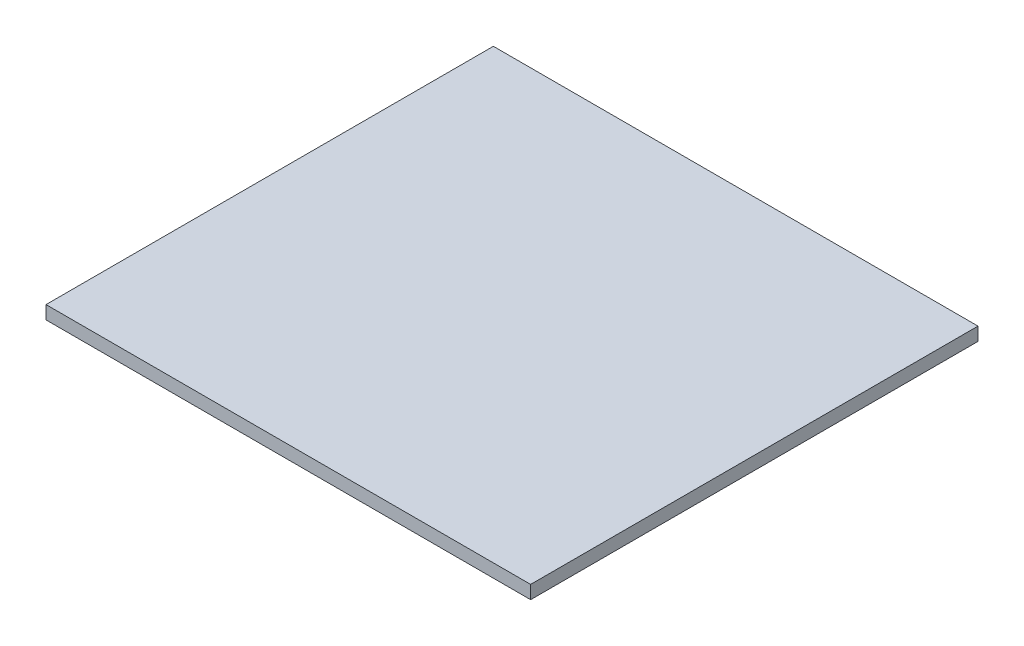
ISO-10303-21;
HEADER;
FILE_DESCRIPTION(('STEP AP214'),'2;1');
FILE_NAME('part.step','',(''),(''),'','','');
FILE_SCHEMA(('AUTOMOTIVE_DESIGN { 1 0 10303 214 1 1 1 1 }'));
ENDSEC;
DATA;
#1=APPLICATION_CONTEXT('core data for automotive mechanical design processes');
#2=APPLICATION_PROTOCOL_DEFINITION('international standard','automotive_design',2000,#1);
#3=PRODUCT_CONTEXT('',#1,'mechanical');
#4=PRODUCT('Part','Part','',(#3));
#5=PRODUCT_RELATED_PRODUCT_CATEGORY('part','',(#4));
#6=PRODUCT_DEFINITION_FORMATION('','',#4);
#7=PRODUCT_DEFINITION_CONTEXT('part definition',#1,'design');
#8=PRODUCT_DEFINITION('design','',#6,#7);
#9=PRODUCT_DEFINITION_SHAPE('','',#8);
#10=(LENGTH_UNIT() NAMED_UNIT(*) SI_UNIT(.MILLI.,.METRE.));
#11=(NAMED_UNIT(*) PLANE_ANGLE_UNIT() SI_UNIT($,.RADIAN.));
#12=(NAMED_UNIT(*) SI_UNIT($,.STERADIAN.) SOLID_ANGLE_UNIT());
#13=UNCERTAINTY_MEASURE_WITH_UNIT(LENGTH_MEASURE(1.E-05),#10,'distance_accuracy_value','');
#14=(GEOMETRIC_REPRESENTATION_CONTEXT(3) GLOBAL_UNCERTAINTY_ASSIGNED_CONTEXT((#13)) GLOBAL_UNIT_ASSIGNED_CONTEXT((#10,
#11,#12)) REPRESENTATION_CONTEXT('',''));
#15=CARTESIAN_POINT('',(0.,0.,0.));
#16=DIRECTION('',(0.,0.,1.));
#17=DIRECTION('',(1.,0.,0.));
#18=AXIS2_PLACEMENT_3D('',#15,#16,#17);
#19=CARTESIAN_POINT('',(-118.587048432742,2.2606,-65.1334894155714));
#20=DIRECTION('',(1.,0.,0.));
#21=DIRECTION('',(0.,0.,-1.));
#22=AXIS2_PLACEMENT_3D('',#19,#20,#21);
#23=PLANE('',#22);
#24=DIRECTION('',(0.,0.,1.));
#25=VECTOR('',#24,1.);
#26=CARTESIAN_POINT('',(-118.587048432742,0.,-65.1334894155714));
#27=LINE('',#26,#25);
#28=CARTESIAN_POINT('',(-118.587048432742,0.,-65.1334894155714));
#29=VERTEX_POINT('',#28);
#30=CARTESIAN_POINT('',(-118.587048432742,0.,11.0665105844286));
#31=VERTEX_POINT('',#30);
#32=EDGE_CURVE('E100',#29,#31,#27,.T.);
#33=ORIENTED_EDGE('',*,*,#32,.T.);
#34=DIRECTION('',(0.,-1.,0.));
#35=VECTOR('',#34,1.);
#36=CARTESIAN_POINT('',(-118.587048432742,2.2606,11.0665105844286));
#37=LINE('',#36,#35);
#38=CARTESIAN_POINT('',(-118.587048432742,2.2606,11.0665105844286));
#39=VERTEX_POINT('',#38);
#40=EDGE_CURVE('E11',#39,#31,#37,.T.);
#41=ORIENTED_EDGE('',*,*,#40,.F.);
#42=DIRECTION('',(0.,0.,1.));
#43=VECTOR('',#42,1.);
#44=CARTESIAN_POINT('',(-118.587048432742,2.2606,-65.1334894155714));
#45=LINE('',#44,#43);
#46=CARTESIAN_POINT('',(-118.587048432742,2.2606,-65.1334894155714));
#47=VERTEX_POINT('',#46);
#48=EDGE_CURVE('E88',#47,#39,#45,.T.);
#49=ORIENTED_EDGE('',*,*,#48,.F.);
#50=DIRECTION('',(0.,-1.,0.));
#51=VECTOR('',#50,1.);
#52=CARTESIAN_POINT('',(-118.587048432742,2.2606,-65.1334894155714));
#53=LINE('',#52,#51);
#54=EDGE_CURVE('E96',#47,#29,#53,.T.);
#55=ORIENTED_EDGE('',*,*,#54,.T.);
#56=EDGE_LOOP('',(#33,#41,#49,#55));
#57=FACE_BOUND('',#56,.T.);
#58=ADVANCED_FACE('F37',(#57),#23,.F.);
#59=CARTESIAN_POINT('',(-118.587048432742,2.2606,11.0665105844286));
#60=DIRECTION('',(0.,0.,-1.));
#61=DIRECTION('',(-1.,0.,0.));
#62=AXIS2_PLACEMENT_3D('',#59,#60,#61);
#63=PLANE('',#62);
#64=DIRECTION('',(1.,0.,0.));
#65=VECTOR('',#64,1.);
#66=CARTESIAN_POINT('',(-118.587048432742,0.,11.0665105844286));
#67=LINE('',#66,#65);
#68=CARTESIAN_POINT('',(-36.0370484327421,0.,11.0665105844286));
#69=VERTEX_POINT('',#68);
#70=EDGE_CURVE('E92',#31,#69,#67,.T.);
#71=ORIENTED_EDGE('',*,*,#70,.T.);
#72=DIRECTION('',(0.,-1.,0.));
#73=VECTOR('',#72,1.);
#74=CARTESIAN_POINT('',(-36.0370484327421,2.2606,11.0665105844286));
#75=LINE('',#74,#73);
#76=CARTESIAN_POINT('',(-36.0370484327421,2.2606,11.0665105844286));
#77=VERTEX_POINT('',#76);
#78=EDGE_CURVE('E45',#77,#69,#75,.T.);
#79=ORIENTED_EDGE('',*,*,#78,.F.);
#80=DIRECTION('',(1.,0.,0.));
#81=VECTOR('',#80,1.);
#82=CARTESIAN_POINT('',(-118.587048432742,2.2606,11.0665105844286));
#83=LINE('',#82,#81);
#84=EDGE_CURVE('E83',#39,#77,#83,.T.);
#85=ORIENTED_EDGE('',*,*,#84,.F.);
#86=ORIENTED_EDGE('',*,*,#40,.T.);
#87=EDGE_LOOP('',(#71,#79,#85,#86));
#88=FACE_BOUND('',#87,.T.);
#89=ADVANCED_FACE('F91',(#88),#63,.F.);
#90=CARTESIAN_POINT('',(-36.0370484327421,2.2606,-65.1334894155714));
#91=DIRECTION('',(-1.,0.,0.));
#92=DIRECTION('',(0.,0.,1.));
#93=AXIS2_PLACEMENT_3D('',#90,#91,#92);
#94=PLANE('',#93);
#95=DIRECTION('',(0.,0.,-1.));
#96=VECTOR('',#95,1.);
#97=CARTESIAN_POINT('',(-36.0370484327421,0.,-65.1334894155714));
#98=LINE('',#97,#96);
#99=CARTESIAN_POINT('',(-36.0370484327421,0.,-65.1334894155714));
#100=VERTEX_POINT('',#99);
#101=EDGE_CURVE('E70',#69,#100,#98,.T.);
#102=ORIENTED_EDGE('',*,*,#101,.T.);
#103=DIRECTION('',(0.,-1.,0.));
#104=VECTOR('',#103,1.);
#105=CARTESIAN_POINT('',(-36.0370484327421,2.2606,-65.1334894155714));
#106=LINE('',#105,#104);
#107=CARTESIAN_POINT('',(-36.0370484327421,2.2606,-65.1334894155714));
#108=VERTEX_POINT('',#107);
#109=EDGE_CURVE('E93',#108,#100,#106,.T.);
#110=ORIENTED_EDGE('',*,*,#109,.F.);
#111=DIRECTION('',(0.,0.,-1.));
#112=VECTOR('',#111,1.);
#113=CARTESIAN_POINT('',(-36.0370484327421,2.2606,-65.1334894155714));
#114=LINE('',#113,#112);
#115=EDGE_CURVE('E86',#77,#108,#114,.T.);
#116=ORIENTED_EDGE('',*,*,#115,.F.);
#117=ORIENTED_EDGE('',*,*,#78,.T.);
#118=EDGE_LOOP('',(#102,#110,#116,#117));
#119=FACE_BOUND('',#118,.T.);
#120=ADVANCED_FACE('F94',(#119),#94,.F.);
#121=CARTESIAN_POINT('',(-118.587048432742,2.2606,-65.1334894155714));
#122=DIRECTION('',(0.,0.,1.));
#123=DIRECTION('',(1.,0.,0.));
#124=AXIS2_PLACEMENT_3D('',#121,#122,#123);
#125=PLANE('',#124);
#126=DIRECTION('',(-1.,0.,0.));
#127=VECTOR('',#126,1.);
#128=CARTESIAN_POINT('',(-118.587048432742,0.,-65.1334894155714));
#129=LINE('',#128,#127);
#130=EDGE_CURVE('E76',#100,#29,#129,.T.);
#131=ORIENTED_EDGE('',*,*,#130,.T.);
#132=ORIENTED_EDGE('',*,*,#54,.F.);
#133=DIRECTION('',(-1.,0.,0.));
#134=VECTOR('',#133,1.);
#135=CARTESIAN_POINT('',(-118.587048432742,2.2606,-65.1334894155714));
#136=LINE('',#135,#134);
#137=EDGE_CURVE('E53',#108,#47,#136,.T.);
#138=ORIENTED_EDGE('',*,*,#137,.F.);
#139=ORIENTED_EDGE('',*,*,#109,.T.);
#140=EDGE_LOOP('',(#131,#132,#138,#139));
#141=FACE_BOUND('',#140,.T.);
#142=ADVANCED_FACE('F107',(#141),#125,.F.);
#143=CARTESIAN_POINT('',(0.,2.2606,0.));
#144=DIRECTION('',(0.,1.,0.));
#145=DIRECTION('',(0.,0.,1.));
#146=AXIS2_PLACEMENT_3D('',#143,#144,#145);
#147=PLANE('',#146);
#148=ORIENTED_EDGE('',*,*,#48,.T.);
#149=ORIENTED_EDGE('',*,*,#84,.T.);
#150=ORIENTED_EDGE('',*,*,#115,.T.);
#151=ORIENTED_EDGE('',*,*,#137,.T.);
#152=EDGE_LOOP('',(#148,#149,#150,#151));
#153=FACE_BOUND('',#152,.T.);
#154=ADVANCED_FACE('F84',(#153),#147,.T.);
#155=CARTESIAN_POINT('',(0.,0.,0.));
#156=DIRECTION('',(0.,1.,0.));
#157=DIRECTION('',(0.,0.,1.));
#158=AXIS2_PLACEMENT_3D('',#155,#156,#157);
#159=PLANE('',#158);
#160=ORIENTED_EDGE('',*,*,#32,.F.);
#161=ORIENTED_EDGE('',*,*,#130,.F.);
#162=ORIENTED_EDGE('',*,*,#101,.F.);
#163=ORIENTED_EDGE('',*,*,#70,.F.);
#164=EDGE_LOOP('',(#160,#161,#162,#163));
#165=FACE_BOUND('',#164,.T.);
#166=ADVANCED_FACE('F110',(#165),#159,.F.);
#167=CLOSED_SHELL('',(#58,#89,#120,#142,#154,#166));
#168=MANIFOLD_SOLID_BREP('B2',#167);
#169=ADVANCED_BREP_SHAPE_REPRESENTATION('',(#18,#168),#14);
#170=SHAPE_DEFINITION_REPRESENTATION(#9,#169);
ENDSEC;
END-ISO-10303-21;
